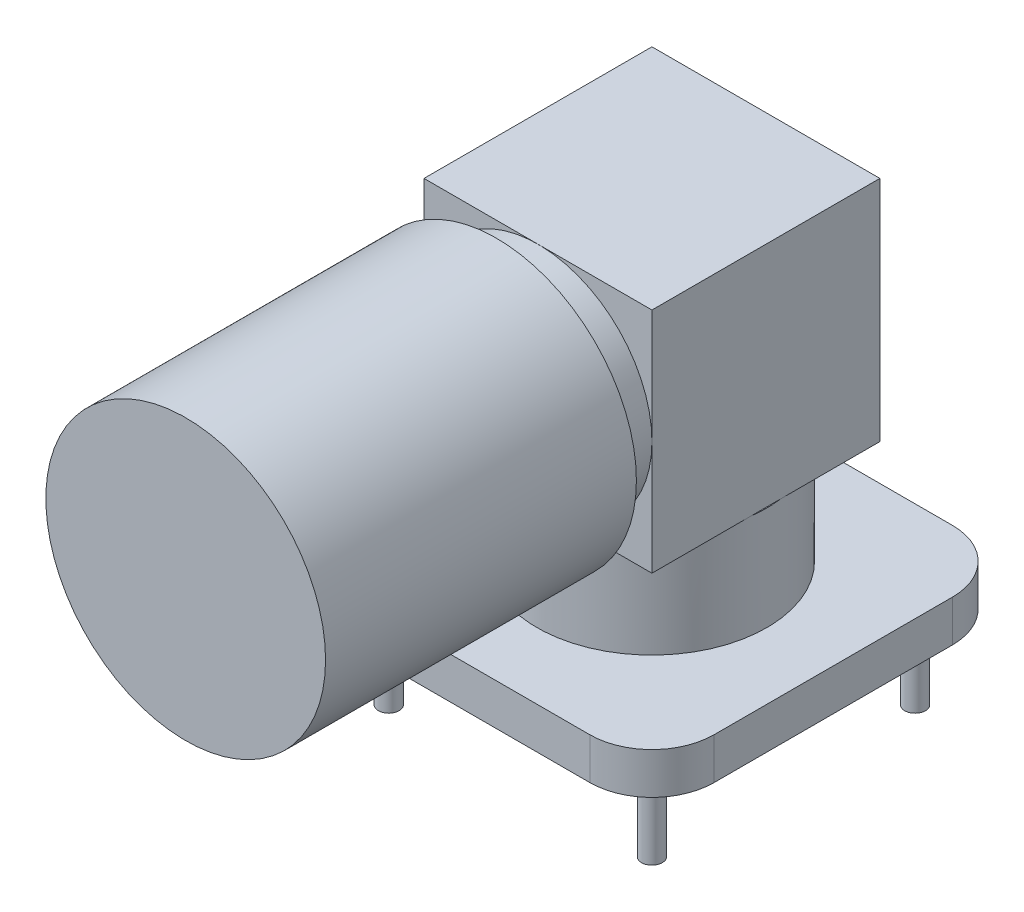
ISO-10303-21;
HEADER;
FILE_DESCRIPTION(('STEP AP214'),'2;1');
FILE_NAME('part.step','',(''),(''),'','','');
FILE_SCHEMA(('AUTOMOTIVE_DESIGN { 1 0 10303 214 1 1 1 1 }'));
ENDSEC;
DATA;
#1=APPLICATION_CONTEXT('core data for automotive mechanical design processes');
#2=APPLICATION_PROTOCOL_DEFINITION('international standard','automotive_design',2000,#1);
#3=PRODUCT_CONTEXT('',#1,'mechanical');
#4=PRODUCT('Part','Part','',(#3));
#5=PRODUCT_RELATED_PRODUCT_CATEGORY('part','',(#4));
#6=PRODUCT_DEFINITION_FORMATION('','',#4);
#7=PRODUCT_DEFINITION_CONTEXT('part definition',#1,'design');
#8=PRODUCT_DEFINITION('design','',#6,#7);
#9=PRODUCT_DEFINITION_SHAPE('','',#8);
#10=(LENGTH_UNIT() NAMED_UNIT(*) SI_UNIT(.MILLI.,.METRE.));
#11=(NAMED_UNIT(*) PLANE_ANGLE_UNIT() SI_UNIT($,.RADIAN.));
#12=(NAMED_UNIT(*) SI_UNIT($,.STERADIAN.) SOLID_ANGLE_UNIT());
#13=UNCERTAINTY_MEASURE_WITH_UNIT(LENGTH_MEASURE(1.E-05),#10,'distance_accuracy_value','');
#14=(GEOMETRIC_REPRESENTATION_CONTEXT(3) GLOBAL_UNCERTAINTY_ASSIGNED_CONTEXT((#13)) GLOBAL_UNIT_ASSIGNED_CONTEXT((#10,
#11,#12)) REPRESENTATION_CONTEXT('',''));
#15=CARTESIAN_POINT('',(0.,0.,0.));
#16=DIRECTION('',(0.,0.,1.));
#17=DIRECTION('',(1.,0.,0.));
#18=AXIS2_PLACEMENT_3D('',#15,#16,#17);
#19=CARTESIAN_POINT('',(0.,12.5,22.5));
#20=DIRECTION('',(0.,0.,-1.));
#21=DIRECTION('',(-1.,0.,0.));
#22=AXIS2_PLACEMENT_3D('',#19,#20,#21);
#23=CYLINDRICAL_SURFACE('',#22,6.75);
#24=CARTESIAN_POINT('',(0.,12.5,22.5));
#25=DIRECTION('',(0.,0.,1.));
#26=DIRECTION('',(1.,0.,0.));
#27=AXIS2_PLACEMENT_3D('',#24,#25,#26);
#28=CIRCLE('',#27,6.75);
#29=CARTESIAN_POINT('',(6.75,12.5,22.5));
#30=VERTEX_POINT('',#29);
#31=EDGE_CURVE('E11',#30,#30,#28,.T.);
#32=ORIENTED_EDGE('',*,*,#31,.F.);
#33=EDGE_LOOP('',(#32));
#34=FACE_BOUND('',#33,.T.);
#35=CARTESIAN_POINT('',(0.,12.5,7.5));
#36=DIRECTION('',(0.,0.,1.));
#37=DIRECTION('',(1.,0.,0.));
#38=AXIS2_PLACEMENT_3D('',#35,#36,#37);
#39=CIRCLE('',#38,6.75);
#40=CARTESIAN_POINT('',(6.75,12.5,7.5));
#41=VERTEX_POINT('',#40);
#42=EDGE_CURVE('E46',#41,#41,#39,.T.);
#43=ORIENTED_EDGE('',*,*,#42,.T.);
#44=EDGE_LOOP('',(#43));
#45=FACE_BOUND('',#44,.T.);
#46=ADVANCED_FACE('F43',(#34,#45),#23,.T.);
#47=CARTESIAN_POINT('',(0.,12.5,22.5));
#48=DIRECTION('',(0.,0.,1.));
#49=DIRECTION('',(1.,0.,0.));
#50=AXIS2_PLACEMENT_3D('',#47,#48,#49);
#51=PLANE('',#50);
#52=ORIENTED_EDGE('',*,*,#31,.T.);
#53=EDGE_LOOP('',(#52));
#54=FACE_BOUND('',#53,.T.);
#55=ADVANCED_FACE('F58',(#54),#51,.T.);
#56=CARTESIAN_POINT('',(0.,12.5,7.5));
#57=DIRECTION('',(0.,0.,1.));
#58=DIRECTION('',(1.,0.,0.));
#59=AXIS2_PLACEMENT_3D('',#56,#57,#58);
#60=PLANE('',#59);
#61=ORIENTED_EDGE('',*,*,#42,.F.);
#62=EDGE_LOOP('',(#61));
#63=FACE_BOUND('',#62,.T.);
#64=ADVANCED_FACE('F56',(#63),#60,.F.);
#65=CLOSED_SHELL('',(#46,#55,#64));
#66=MANIFOLD_SOLID_BREP('B2',#65);
#67=CARTESIAN_POINT('',(0.,12.5,15.5));
#68=DIRECTION('',(0.,0.,-1.));
#69=DIRECTION('',(-1.,0.,0.));
#70=AXIS2_PLACEMENT_3D('',#67,#68,#69);
#71=CYLINDRICAL_SURFACE('',#70,5.5);
#72=CARTESIAN_POINT('',(0.,12.5,15.5));
#73=DIRECTION('',(0.,0.,1.));
#74=DIRECTION('',(1.,0.,0.));
#75=AXIS2_PLACEMENT_3D('',#72,#73,#74);
#76=CIRCLE('',#75,5.5);
#77=CARTESIAN_POINT('',(5.5,12.5,15.5));
#78=VERTEX_POINT('',#77);
#79=EDGE_CURVE('E42',#78,#78,#76,.T.);
#80=ORIENTED_EDGE('',*,*,#79,.F.);
#81=EDGE_LOOP('',(#80));
#82=FACE_BOUND('',#81,.T.);
#83=CARTESIAN_POINT('',(0.,12.5,5.5));
#84=DIRECTION('',(0.,0.,1.));
#85=DIRECTION('',(1.,0.,0.));
#86=AXIS2_PLACEMENT_3D('',#83,#84,#85);
#87=CIRCLE('',#86,5.5);
#88=CARTESIAN_POINT('',(5.5,12.5,5.5));
#89=VERTEX_POINT('',#88);
#90=EDGE_CURVE('E95',#89,#89,#87,.T.);
#91=ORIENTED_EDGE('',*,*,#90,.T.);
#92=EDGE_LOOP('',(#91));
#93=FACE_BOUND('',#92,.T.);
#94=ADVANCED_FACE('F92',(#82,#93),#71,.T.);
#95=CARTESIAN_POINT('',(0.,12.5,15.5));
#96=DIRECTION('',(0.,0.,1.));
#97=DIRECTION('',(1.,0.,0.));
#98=AXIS2_PLACEMENT_3D('',#95,#96,#97);
#99=PLANE('',#98);
#100=ORIENTED_EDGE('',*,*,#79,.T.);
#101=EDGE_LOOP('',(#100));
#102=FACE_BOUND('',#101,.T.);
#103=ADVANCED_FACE('F107',(#102),#99,.T.);
#104=CARTESIAN_POINT('',(0.,12.5,5.5));
#105=DIRECTION('',(0.,0.,1.));
#106=DIRECTION('',(1.,0.,0.));
#107=AXIS2_PLACEMENT_3D('',#104,#105,#106);
#108=PLANE('',#107);
#109=ORIENTED_EDGE('',*,*,#90,.F.);
#110=EDGE_LOOP('',(#109));
#111=FACE_BOUND('',#110,.T.);
#112=ADVANCED_FACE('F105',(#111),#108,.F.);
#113=CLOSED_SHELL('',(#94,#103,#112));
#114=MANIFOLD_SOLID_BREP('B6',#113);
#115=CARTESIAN_POINT('',(0.,7.,0.));
#116=DIRECTION('',(0.,1.,0.));
#117=DIRECTION('',(0.,0.,1.));
#118=AXIS2_PLACEMENT_3D('',#115,#116,#117);
#119=PLANE('',#118);
#120=DIRECTION('',(0.,0.,-1.));
#121=VECTOR('',#120,1.);
#122=CARTESIAN_POINT('',(5.5,7.,-5.5));
#123=LINE('',#122,#121);
#124=CARTESIAN_POINT('',(5.5,7.,0.743303437365921));
#125=VERTEX_POINT('',#124);
#126=CARTESIAN_POINT('',(5.5,7.,-0.743303437365923));
#127=VERTEX_POINT('',#126);
#128=EDGE_CURVE('E90',#125,#127,#123,.T.);
#129=ORIENTED_EDGE('',*,*,#128,.F.);
#130=CARTESIAN_POINT('',(0.,7.,0.));
#131=DIRECTION('',(0.,1.,0.));
#132=DIRECTION('',(0.,0.,1.));
#133=AXIS2_PLACEMENT_3D('',#130,#131,#132);
#134=CIRCLE('',#133,5.55);
#135=EDGE_CURVE('E285',#125,#127,#134,.T.);
#136=ORIENTED_EDGE('',*,*,#135,.T.);
#137=EDGE_LOOP('',(#129,#136));
#138=FACE_BOUND('',#137,.T.);
#139=ADVANCED_FACE('F132',(#138),#119,.T.);
#140=DIRECTION('',(1.,0.,0.));
#141=VECTOR('',#140,1.);
#142=CARTESIAN_POINT('',(-5.5,7.,5.5));
#143=LINE('',#142,#141);
#144=CARTESIAN_POINT('',(-0.743303437365922,7.,5.5));
#145=VERTEX_POINT('',#144);
#146=CARTESIAN_POINT('',(0.743303437365922,7.,5.5));
#147=VERTEX_POINT('',#146);
#148=EDGE_CURVE('E141',#145,#147,#143,.T.);
#149=ORIENTED_EDGE('',*,*,#148,.F.);
#150=EDGE_CURVE('E275',#145,#147,#134,.T.);
#151=ORIENTED_EDGE('',*,*,#150,.T.);
#152=EDGE_LOOP('',(#149,#151));
#153=FACE_BOUND('',#152,.T.);
#154=ADVANCED_FACE('F438',(#153),#119,.T.);
#155=DIRECTION('',(0.,0.,1.));
#156=VECTOR('',#155,1.);
#157=CARTESIAN_POINT('',(-5.5,7.,-5.5));
#158=LINE('',#157,#156);
#159=CARTESIAN_POINT('',(-5.5,7.,-0.743303437365934));
#160=VERTEX_POINT('',#159);
#161=CARTESIAN_POINT('',(-5.5,7.,0.743303437365937));
#162=VERTEX_POINT('',#161);
#163=EDGE_CURVE('E378',#160,#162,#158,.T.);
#164=ORIENTED_EDGE('',*,*,#163,.F.);
#165=EDGE_CURVE('E408',#160,#162,#134,.T.);
#166=ORIENTED_EDGE('',*,*,#165,.T.);
#167=EDGE_LOOP('',(#164,#166));
#168=FACE_BOUND('',#167,.T.);
#169=ADVANCED_FACE('F443',(#168),#119,.T.);
#170=CARTESIAN_POINT('',(-5.75000000000001,2.,5.75));
#171=DIRECTION('',(0.,-1.,0.));
#172=DIRECTION('',(0.,0.,-1.));
#173=AXIS2_PLACEMENT_3D('',#170,#171,#172);
#174=PLANE('',#173);
#175=CARTESIAN_POINT('',(-5.75000000000001,2.,5.75));
#176=DIRECTION('',(0.,1.,0.));
#177=DIRECTION('',(0.,0.,-1.));
#178=AXIS2_PLACEMENT_3D('',#175,#176,#177);
#179=CIRCLE('',#178,3.);
#180=CARTESIAN_POINT('',(-8.75000000000001,2.,5.74999999999998));
#181=VERTEX_POINT('',#180);
#182=CARTESIAN_POINT('',(-5.74999999999999,2.,8.75));
#183=VERTEX_POINT('',#182);
#184=EDGE_CURVE('E316',#181,#183,#179,.T.);
#185=ORIENTED_EDGE('',*,*,#184,.T.);
#186=DIRECTION('',(1.,0.,0.));
#187=VECTOR('',#186,1.);
#188=CARTESIAN_POINT('',(-5.74999999999999,2.,8.75));
#189=LINE('',#188,#187);
#190=CARTESIAN_POINT('',(5.74999999999997,2.,8.75));
#191=VERTEX_POINT('',#190);
#192=EDGE_CURVE('E319',#183,#191,#189,.T.);
#193=ORIENTED_EDGE('',*,*,#192,.T.);
#194=CARTESIAN_POINT('',(5.74999999999999,2.,5.75));
#195=DIRECTION('',(0.,1.,0.));
#196=DIRECTION('',(0.,0.,1.));
#197=AXIS2_PLACEMENT_3D('',#194,#195,#196);
#198=CIRCLE('',#197,3.);
#199=CARTESIAN_POINT('',(8.74999999999999,2.,5.74999999999998));
#200=VERTEX_POINT('',#199);
#201=EDGE_CURVE('E322',#191,#200,#198,.T.);
#202=ORIENTED_EDGE('',*,*,#201,.T.);
#203=DIRECTION('',(0.,0.,-1.));
#204=VECTOR('',#203,1.);
#205=CARTESIAN_POINT('',(8.74999999999999,2.,5.74999999999998));
#206=LINE('',#205,#204);
#207=CARTESIAN_POINT('',(8.74999999999999,2.,-5.74999999999998));
#208=VERTEX_POINT('',#207);
#209=EDGE_CURVE('E324',#200,#208,#206,.T.);
#210=ORIENTED_EDGE('',*,*,#209,.T.);
#211=CARTESIAN_POINT('',(5.74999999999999,2.,-5.75));
#212=DIRECTION('',(0.,1.,0.));
#213=DIRECTION('',(0.,0.,-1.));
#214=AXIS2_PLACEMENT_3D('',#211,#212,#213);
#215=CIRCLE('',#214,3.);
#216=CARTESIAN_POINT('',(5.74999999999997,2.,-8.75));
#217=VERTEX_POINT('',#216);
#218=EDGE_CURVE('E326',#208,#217,#215,.T.);
#219=ORIENTED_EDGE('',*,*,#218,.T.);
#220=DIRECTION('',(-1.,0.,0.));
#221=VECTOR('',#220,1.);
#222=CARTESIAN_POINT('',(-5.74999999999999,2.,-8.75));
#223=LINE('',#222,#221);
#224=CARTESIAN_POINT('',(-5.74999999999999,2.,-8.75));
#225=VERTEX_POINT('',#224);
#226=EDGE_CURVE('E328',#217,#225,#223,.T.);
#227=ORIENTED_EDGE('',*,*,#226,.T.);
#228=CARTESIAN_POINT('',(-5.75000000000001,2.,-5.75));
#229=DIRECTION('',(0.,1.,0.));
#230=DIRECTION('',(0.,0.,-1.));
#231=AXIS2_PLACEMENT_3D('',#228,#229,#230);
#232=CIRCLE('',#231,3.);
#233=CARTESIAN_POINT('',(-8.75000000000001,2.,-5.74999999999998));
#234=VERTEX_POINT('',#233);
#235=EDGE_CURVE('E330',#225,#234,#232,.T.);
#236=ORIENTED_EDGE('',*,*,#235,.T.);
#237=DIRECTION('',(0.,0.,1.));
#238=VECTOR('',#237,1.);
#239=CARTESIAN_POINT('',(-8.75000000000001,2.,5.74999999999998));
#240=LINE('',#239,#238);
#241=EDGE_CURVE('E332',#234,#181,#240,.T.);
#242=ORIENTED_EDGE('',*,*,#241,.T.);
#243=EDGE_LOOP('',(#185,#193,#202,#210,#219,#227,#236,#242));
#244=FACE_BOUND('',#243,.T.);
#245=CARTESIAN_POINT('',(0.,2.,0.));
#246=DIRECTION('',(0.,-1.,0.));
#247=DIRECTION('',(0.,0.,-1.));
#248=AXIS2_PLACEMENT_3D('',#245,#246,#247);
#249=CIRCLE('',#248,5.55);
#250=CARTESIAN_POINT('',(0.,2.,-5.55));
#251=VERTEX_POINT('',#250);
#252=EDGE_CURVE('E136',#251,#251,#249,.F.);
#253=ORIENTED_EDGE('',*,*,#252,.F.);
#254=EDGE_LOOP('',(#253));
#255=FACE_BOUND('',#254,.T.);
#256=ADVANCED_FACE('F453',(#244,#255),#174,.F.);
#257=CARTESIAN_POINT('',(-5.75000000000001,0.,5.75));
#258=DIRECTION('',(0.,-1.,0.));
#259=DIRECTION('',(0.,0.,-1.));
#260=AXIS2_PLACEMENT_3D('',#257,#258,#259);
#261=PLANE('',#260);
#262=CARTESIAN_POINT('',(6.35,0.,6.35));
#263=DIRECTION('',(0.,-1.,0.));
#264=DIRECTION('',(0.,0.,-1.));
#265=AXIS2_PLACEMENT_3D('',#262,#263,#264);
#266=CIRCLE('',#265,0.5);
#267=CARTESIAN_POINT('',(6.35,0.,5.85));
#268=VERTEX_POINT('',#267);
#269=EDGE_CURVE('E289',#268,#268,#266,.T.);
#270=ORIENTED_EDGE('',*,*,#269,.F.);
#271=EDGE_LOOP('',(#270));
#272=FACE_BOUND('',#271,.T.);
#273=CARTESIAN_POINT('',(0.,0.,0.));
#274=DIRECTION('',(0.,-1.,0.));
#275=DIRECTION('',(0.,0.,-1.));
#276=AXIS2_PLACEMENT_3D('',#273,#274,#275);
#277=CIRCLE('',#276,0.5);
#278=CARTESIAN_POINT('',(0.,0.,-0.5));
#279=VERTEX_POINT('',#278);
#280=EDGE_CURVE('E301',#279,#279,#277,.T.);
#281=ORIENTED_EDGE('',*,*,#280,.F.);
#282=EDGE_LOOP('',(#281));
#283=FACE_BOUND('',#282,.T.);
#284=CARTESIAN_POINT('',(-5.75000000000001,0.,5.75));
#285=DIRECTION('',(0.,1.,0.));
#286=DIRECTION('',(0.,0.,-1.));
#287=AXIS2_PLACEMENT_3D('',#284,#285,#286);
#288=CIRCLE('',#287,3.);
#289=CARTESIAN_POINT('',(-8.75000000000001,0.,5.74999999999998));
#290=VERTEX_POINT('',#289);
#291=CARTESIAN_POINT('',(-5.74999999999999,0.,8.75));
#292=VERTEX_POINT('',#291);
#293=EDGE_CURVE('E313',#290,#292,#288,.T.);
#294=ORIENTED_EDGE('',*,*,#293,.F.);
#295=DIRECTION('',(0.,0.,1.));
#296=VECTOR('',#295,1.);
#297=CARTESIAN_POINT('',(-8.75000000000001,0.,5.74999999999998));
#298=LINE('',#297,#296);
#299=CARTESIAN_POINT('',(-8.75000000000001,0.,-5.74999999999998));
#300=VERTEX_POINT('',#299);
#301=EDGE_CURVE('E320',#300,#290,#298,.T.);
#302=ORIENTED_EDGE('',*,*,#301,.F.);
#303=CARTESIAN_POINT('',(-5.75000000000001,0.,-5.75));
#304=DIRECTION('',(0.,1.,0.));
#305=DIRECTION('',(0.,0.,-1.));
#306=AXIS2_PLACEMENT_3D('',#303,#304,#305);
#307=CIRCLE('',#306,3.);
#308=CARTESIAN_POINT('',(-5.74999999999999,0.,-8.75));
#309=VERTEX_POINT('',#308);
#310=EDGE_CURVE('E347',#309,#300,#307,.T.);
#311=ORIENTED_EDGE('',*,*,#310,.F.);
#312=DIRECTION('',(-1.,0.,0.));
#313=VECTOR('',#312,1.);
#314=CARTESIAN_POINT('',(-5.74999999999999,0.,-8.75));
#315=LINE('',#314,#313);
#316=CARTESIAN_POINT('',(5.74999999999997,0.,-8.75));
#317=VERTEX_POINT('',#316);
#318=EDGE_CURVE('E345',#317,#309,#315,.T.);
#319=ORIENTED_EDGE('',*,*,#318,.F.);
#320=CARTESIAN_POINT('',(5.74999999999999,0.,-5.75));
#321=DIRECTION('',(0.,1.,0.));
#322=DIRECTION('',(0.,0.,-1.));
#323=AXIS2_PLACEMENT_3D('',#320,#321,#322);
#324=CIRCLE('',#323,3.);
#325=CARTESIAN_POINT('',(8.74999999999999,0.,-5.74999999999998));
#326=VERTEX_POINT('',#325);
#327=EDGE_CURVE('E343',#326,#317,#324,.T.);
#328=ORIENTED_EDGE('',*,*,#327,.F.);
#329=DIRECTION('',(0.,0.,-1.));
#330=VECTOR('',#329,1.);
#331=CARTESIAN_POINT('',(8.74999999999999,0.,5.74999999999998));
#332=LINE('',#331,#330);
#333=CARTESIAN_POINT('',(8.74999999999999,0.,5.74999999999998));
#334=VERTEX_POINT('',#333);
#335=EDGE_CURVE('E341',#334,#326,#332,.T.);
#336=ORIENTED_EDGE('',*,*,#335,.F.);
#337=CARTESIAN_POINT('',(5.74999999999999,0.,5.75));
#338=DIRECTION('',(0.,1.,0.));
#339=DIRECTION('',(0.,0.,1.));
#340=AXIS2_PLACEMENT_3D('',#337,#338,#339);
#341=CIRCLE('',#340,3.);
#342=CARTESIAN_POINT('',(5.74999999999997,0.,8.75));
#343=VERTEX_POINT('',#342);
#344=EDGE_CURVE('E339',#343,#334,#341,.T.);
#345=ORIENTED_EDGE('',*,*,#344,.F.);
#346=DIRECTION('',(1.,0.,0.));
#347=VECTOR('',#346,1.);
#348=CARTESIAN_POINT('',(-5.74999999999999,0.,8.75));
#349=LINE('',#348,#347);
#350=EDGE_CURVE('E337',#292,#343,#349,.T.);
#351=ORIENTED_EDGE('',*,*,#350,.F.);
#352=EDGE_LOOP('',(#294,#302,#311,#319,#328,#336,#345,#351));
#353=FACE_BOUND('',#352,.T.);
#354=CARTESIAN_POINT('',(6.35,0.,-6.35));
#355=DIRECTION('',(0.,-1.,0.));
#356=DIRECTION('',(0.,0.,-1.));
#357=AXIS2_PLACEMENT_3D('',#354,#355,#356);
#358=CIRCLE('',#357,0.500000000000001);
#359=CARTESIAN_POINT('',(6.35,0.,-6.85));
#360=VERTEX_POINT('',#359);
#361=EDGE_CURVE('E307',#360,#360,#358,.T.);
#362=ORIENTED_EDGE('',*,*,#361,.F.);
#363=EDGE_LOOP('',(#362));
#364=FACE_BOUND('',#363,.T.);
#365=CARTESIAN_POINT('',(-6.35,0.,6.35));
#366=DIRECTION('',(0.,-1.,0.));
#367=DIRECTION('',(0.,0.,-1.));
#368=AXIS2_PLACEMENT_3D('',#365,#366,#367);
#369=CIRCLE('',#368,0.5);
#370=CARTESIAN_POINT('',(-6.35,0.,5.85));
#371=VERTEX_POINT('',#370);
#372=EDGE_CURVE('E295',#371,#371,#369,.T.);
#373=ORIENTED_EDGE('',*,*,#372,.F.);
#374=EDGE_LOOP('',(#373));
#375=FACE_BOUND('',#374,.T.);
#376=CARTESIAN_POINT('',(-6.35,0.,-6.35));
#377=DIRECTION('',(0.,-1.,0.));
#378=DIRECTION('',(0.,0.,-1.));
#379=AXIS2_PLACEMENT_3D('',#376,#377,#378);
#380=CIRCLE('',#379,0.5);
#381=CARTESIAN_POINT('',(-6.35,0.,-6.85));
#382=VERTEX_POINT('',#381);
#383=EDGE_CURVE('E284',#382,#382,#380,.T.);
#384=ORIENTED_EDGE('',*,*,#383,.F.);
#385=EDGE_LOOP('',(#384));
#386=FACE_BOUND('',#385,.T.);
#387=ADVANCED_FACE('F457',(#272,#283,#353,#364,#375,#386),#261,.T.);
#388=CARTESIAN_POINT('',(-5.75000000000001,2.,5.75));
#389=DIRECTION('',(0.,-1.,0.));
#390=DIRECTION('',(0.,0.,-1.));
#391=AXIS2_PLACEMENT_3D('',#388,#389,#390);
#392=CYLINDRICAL_SURFACE('',#391,3.);
#393=ORIENTED_EDGE('',*,*,#293,.T.);
#394=DIRECTION('',(0.,-1.,0.));
#395=VECTOR('',#394,1.);
#396=CARTESIAN_POINT('',(-5.74999999999999,2.,8.75));
#397=LINE('',#396,#395);
#398=EDGE_CURVE('E369',#183,#292,#397,.T.);
#399=ORIENTED_EDGE('',*,*,#398,.F.);
#400=ORIENTED_EDGE('',*,*,#184,.F.);
#401=DIRECTION('',(0.,-1.,0.));
#402=VECTOR('',#401,1.);
#403=CARTESIAN_POINT('',(-8.75000000000001,2.,5.74999999999998));
#404=LINE('',#403,#402);
#405=EDGE_CURVE('E334',#181,#290,#404,.T.);
#406=ORIENTED_EDGE('',*,*,#405,.T.);
#407=EDGE_LOOP('',(#393,#399,#400,#406));
#408=FACE_BOUND('',#407,.T.);
#409=ADVANCED_FACE('F134',(#408),#392,.T.);
#410=CARTESIAN_POINT('',(-5.74999999999999,2.,8.75));
#411=DIRECTION('',(0.,0.,-1.));
#412=DIRECTION('',(-1.,0.,0.));
#413=AXIS2_PLACEMENT_3D('',#410,#411,#412);
#414=PLANE('',#413);
#415=ORIENTED_EDGE('',*,*,#350,.T.);
#416=DIRECTION('',(0.,-1.,0.));
#417=VECTOR('',#416,1.);
#418=CARTESIAN_POINT('',(5.74999999999997,2.,8.75));
#419=LINE('',#418,#417);
#420=EDGE_CURVE('E367',#191,#343,#419,.T.);
#421=ORIENTED_EDGE('',*,*,#420,.F.);
#422=ORIENTED_EDGE('',*,*,#192,.F.);
#423=ORIENTED_EDGE('',*,*,#398,.T.);
#424=EDGE_LOOP('',(#415,#421,#422,#423));
#425=FACE_BOUND('',#424,.T.);
#426=ADVANCED_FACE('F492',(#425),#414,.F.);
#427=CARTESIAN_POINT('',(5.74999999999999,2.,5.75));
#428=DIRECTION('',(0.,-1.,0.));
#429=DIRECTION('',(0.,0.,-1.));
#430=AXIS2_PLACEMENT_3D('',#427,#428,#429);
#431=CYLINDRICAL_SURFACE('',#430,3.);
#432=ORIENTED_EDGE('',*,*,#344,.T.);
#433=DIRECTION('',(0.,-1.,0.));
#434=VECTOR('',#433,1.);
#435=CARTESIAN_POINT('',(8.74999999999999,2.,5.74999999999998));
#436=LINE('',#435,#434);
#437=EDGE_CURVE('E364',#200,#334,#436,.T.);
#438=ORIENTED_EDGE('',*,*,#437,.F.);
#439=ORIENTED_EDGE('',*,*,#201,.F.);
#440=ORIENTED_EDGE('',*,*,#420,.T.);
#441=EDGE_LOOP('',(#432,#438,#439,#440));
#442=FACE_BOUND('',#441,.T.);
#443=ADVANCED_FACE('F489',(#442),#431,.T.);
#444=CARTESIAN_POINT('',(8.74999999999999,2.,5.74999999999998));
#445=DIRECTION('',(-1.,0.,0.));
#446=DIRECTION('',(0.,0.,1.));
#447=AXIS2_PLACEMENT_3D('',#444,#445,#446);
#448=PLANE('',#447);
#449=ORIENTED_EDGE('',*,*,#335,.T.);
#450=DIRECTION('',(0.,-1.,0.));
#451=VECTOR('',#450,1.);
#452=CARTESIAN_POINT('',(8.74999999999999,2.,-5.74999999999998));
#453=LINE('',#452,#451);
#454=EDGE_CURVE('E361',#208,#326,#453,.T.);
#455=ORIENTED_EDGE('',*,*,#454,.F.);
#456=ORIENTED_EDGE('',*,*,#209,.F.);
#457=ORIENTED_EDGE('',*,*,#437,.T.);
#458=EDGE_LOOP('',(#449,#455,#456,#457));
#459=FACE_BOUND('',#458,.T.);
#460=ADVANCED_FACE('F485',(#459),#448,.F.);
#461=CARTESIAN_POINT('',(5.74999999999999,2.,-5.75));
#462=DIRECTION('',(0.,-1.,0.));
#463=DIRECTION('',(0.,0.,-1.));
#464=AXIS2_PLACEMENT_3D('',#461,#462,#463);
#465=CYLINDRICAL_SURFACE('',#464,3.);
#466=ORIENTED_EDGE('',*,*,#327,.T.);
#467=DIRECTION('',(0.,-1.,0.));
#468=VECTOR('',#467,1.);
#469=CARTESIAN_POINT('',(5.74999999999997,2.,-8.75));
#470=LINE('',#469,#468);
#471=EDGE_CURVE('E358',#217,#317,#470,.T.);
#472=ORIENTED_EDGE('',*,*,#471,.F.);
#473=ORIENTED_EDGE('',*,*,#218,.F.);
#474=ORIENTED_EDGE('',*,*,#454,.T.);
#475=EDGE_LOOP('',(#466,#472,#473,#474));
#476=FACE_BOUND('',#475,.T.);
#477=ADVANCED_FACE('F481',(#476),#465,.T.);
#478=CARTESIAN_POINT('',(-5.74999999999999,2.,-8.75));
#479=DIRECTION('',(0.,0.,1.));
#480=DIRECTION('',(1.,0.,0.));
#481=AXIS2_PLACEMENT_3D('',#478,#479,#480);
#482=PLANE('',#481);
#483=ORIENTED_EDGE('',*,*,#318,.T.);
#484=DIRECTION('',(0.,-1.,0.));
#485=VECTOR('',#484,1.);
#486=CARTESIAN_POINT('',(-5.74999999999999,2.,-8.75));
#487=LINE('',#486,#485);
#488=EDGE_CURVE('E355',#225,#309,#487,.T.);
#489=ORIENTED_EDGE('',*,*,#488,.F.);
#490=ORIENTED_EDGE('',*,*,#226,.F.);
#491=ORIENTED_EDGE('',*,*,#471,.T.);
#492=EDGE_LOOP('',(#483,#489,#490,#491));
#493=FACE_BOUND('',#492,.T.);
#494=ADVANCED_FACE('F477',(#493),#482,.F.);
#495=CARTESIAN_POINT('',(-5.75000000000001,2.,-5.75));
#496=DIRECTION('',(0.,-1.,0.));
#497=DIRECTION('',(0.,0.,-1.));
#498=AXIS2_PLACEMENT_3D('',#495,#496,#497);
#499=CYLINDRICAL_SURFACE('',#498,3.);
#500=ORIENTED_EDGE('',*,*,#310,.T.);
#501=DIRECTION('',(0.,-1.,0.));
#502=VECTOR('',#501,1.);
#503=CARTESIAN_POINT('',(-8.75000000000001,2.,-5.74999999999998));
#504=LINE('',#503,#502);
#505=EDGE_CURVE('E352',#234,#300,#504,.T.);
#506=ORIENTED_EDGE('',*,*,#505,.F.);
#507=ORIENTED_EDGE('',*,*,#235,.F.);
#508=ORIENTED_EDGE('',*,*,#488,.T.);
#509=EDGE_LOOP('',(#500,#506,#507,#508));
#510=FACE_BOUND('',#509,.T.);
#511=ADVANCED_FACE('F473',(#510),#499,.T.);
#512=CARTESIAN_POINT('',(-8.75000000000001,2.,5.74999999999998));
#513=DIRECTION('',(1.,0.,0.));
#514=DIRECTION('',(0.,0.,-1.));
#515=AXIS2_PLACEMENT_3D('',#512,#513,#514);
#516=PLANE('',#515);
#517=ORIENTED_EDGE('',*,*,#301,.T.);
#518=ORIENTED_EDGE('',*,*,#405,.F.);
#519=ORIENTED_EDGE('',*,*,#241,.F.);
#520=ORIENTED_EDGE('',*,*,#505,.T.);
#521=EDGE_LOOP('',(#517,#518,#519,#520));
#522=FACE_BOUND('',#521,.T.);
#523=ADVANCED_FACE('F470',(#522),#516,.F.);
#524=CARTESIAN_POINT('',(6.35,-4.,-6.35));
#525=DIRECTION('',(0.,1.,0.));
#526=DIRECTION('',(0.,0.,1.));
#527=AXIS2_PLACEMENT_3D('',#524,#525,#526);
#528=CYLINDRICAL_SURFACE('',#527,0.500000000000001);
#529=CARTESIAN_POINT('',(6.35,-4.,-6.35));
#530=DIRECTION('',(0.,-1.,0.));
#531=DIRECTION('',(0.,0.,-1.));
#532=AXIS2_PLACEMENT_3D('',#529,#530,#531);
#533=CIRCLE('',#532,0.500000000000001);
#534=CARTESIAN_POINT('',(6.35,-4.,-6.85));
#535=VERTEX_POINT('',#534);
#536=EDGE_CURVE('E310',#535,#535,#533,.T.);
#537=ORIENTED_EDGE('',*,*,#536,.F.);
#538=EDGE_LOOP('',(#537));
#539=FACE_BOUND('',#538,.T.);
#540=ORIENTED_EDGE('',*,*,#361,.T.);
#541=EDGE_LOOP('',(#540));
#542=FACE_BOUND('',#541,.T.);
#543=ADVANCED_FACE('F467',(#539,#542),#528,.T.);
#544=CARTESIAN_POINT('',(6.35,-4.,-6.35));
#545=DIRECTION('',(0.,-1.,0.));
#546=DIRECTION('',(0.,0.,-1.));
#547=AXIS2_PLACEMENT_3D('',#544,#545,#546);
#548=PLANE('',#547);
#549=ORIENTED_EDGE('',*,*,#536,.T.);
#550=EDGE_LOOP('',(#549));
#551=FACE_BOUND('',#550,.T.);
#552=ADVANCED_FACE('F561',(#551),#548,.T.);
#553=CARTESIAN_POINT('',(0.,-4.,0.));
#554=DIRECTION('',(0.,1.,0.));
#555=DIRECTION('',(0.,0.,1.));
#556=AXIS2_PLACEMENT_3D('',#553,#554,#555);
#557=CYLINDRICAL_SURFACE('',#556,0.5);
#558=CARTESIAN_POINT('',(0.,-4.,0.));
#559=DIRECTION('',(0.,-1.,0.));
#560=DIRECTION('',(0.,0.,-1.));
#561=AXIS2_PLACEMENT_3D('',#558,#559,#560);
#562=CIRCLE('',#561,0.5);
#563=CARTESIAN_POINT('',(0.,-4.,-0.5));
#564=VERTEX_POINT('',#563);
#565=EDGE_CURVE('E304',#564,#564,#562,.T.);
#566=ORIENTED_EDGE('',*,*,#565,.F.);
#567=EDGE_LOOP('',(#566));
#568=FACE_BOUND('',#567,.T.);
#569=ORIENTED_EDGE('',*,*,#280,.T.);
#570=EDGE_LOOP('',(#569));
#571=FACE_BOUND('',#570,.T.);
#572=ADVANCED_FACE('F558',(#568,#571),#557,.T.);
#573=CARTESIAN_POINT('',(0.,-4.,0.));
#574=DIRECTION('',(0.,-1.,0.));
#575=DIRECTION('',(0.,0.,-1.));
#576=AXIS2_PLACEMENT_3D('',#573,#574,#575);
#577=PLANE('',#576);
#578=ORIENTED_EDGE('',*,*,#565,.T.);
#579=EDGE_LOOP('',(#578));
#580=FACE_BOUND('',#579,.T.);
#581=ADVANCED_FACE('F554',(#580),#577,.T.);
#582=CARTESIAN_POINT('',(-6.35,-4.,6.35));
#583=DIRECTION('',(0.,1.,0.));
#584=DIRECTION('',(0.,0.,1.));
#585=AXIS2_PLACEMENT_3D('',#582,#583,#584);
#586=CYLINDRICAL_SURFACE('',#585,0.5);
#587=CARTESIAN_POINT('',(-6.35,-4.,6.35));
#588=DIRECTION('',(0.,-1.,0.));
#589=DIRECTION('',(0.,0.,-1.));
#590=AXIS2_PLACEMENT_3D('',#587,#588,#589);
#591=CIRCLE('',#590,0.5);
#592=CARTESIAN_POINT('',(-6.35,-4.,5.85));
#593=VERTEX_POINT('',#592);
#594=EDGE_CURVE('E298',#593,#593,#591,.T.);
#595=ORIENTED_EDGE('',*,*,#594,.F.);
#596=EDGE_LOOP('',(#595));
#597=FACE_BOUND('',#596,.T.);
#598=ORIENTED_EDGE('',*,*,#372,.T.);
#599=EDGE_LOOP('',(#598));
#600=FACE_BOUND('',#599,.T.);
#601=ADVANCED_FACE('F550',(#597,#600),#586,.T.);
#602=CARTESIAN_POINT('',(-6.35,-4.,6.35));
#603=DIRECTION('',(0.,-1.,0.));
#604=DIRECTION('',(0.,0.,-1.));
#605=AXIS2_PLACEMENT_3D('',#602,#603,#604);
#606=PLANE('',#605);
#607=ORIENTED_EDGE('',*,*,#594,.T.);
#608=EDGE_LOOP('',(#607));
#609=FACE_BOUND('',#608,.T.);
#610=ADVANCED_FACE('F546',(#609),#606,.T.);
#611=CARTESIAN_POINT('',(6.35,-4.,6.35));
#612=DIRECTION('',(0.,1.,0.));
#613=DIRECTION('',(0.,0.,1.));
#614=AXIS2_PLACEMENT_3D('',#611,#612,#613);
#615=CYLINDRICAL_SURFACE('',#614,0.5);
#616=CARTESIAN_POINT('',(6.35,-4.,6.35));
#617=DIRECTION('',(0.,-1.,0.));
#618=DIRECTION('',(0.,0.,-1.));
#619=AXIS2_PLACEMENT_3D('',#616,#617,#618);
#620=CIRCLE('',#619,0.5);
#621=CARTESIAN_POINT('',(6.35,-4.,5.85));
#622=VERTEX_POINT('',#621);
#623=EDGE_CURVE('E292',#622,#622,#620,.T.);
#624=ORIENTED_EDGE('',*,*,#623,.F.);
#625=EDGE_LOOP('',(#624));
#626=FACE_BOUND('',#625,.T.);
#627=ORIENTED_EDGE('',*,*,#269,.T.);
#628=EDGE_LOOP('',(#627));
#629=FACE_BOUND('',#628,.T.);
#630=ADVANCED_FACE('F539',(#626,#629),#615,.T.);
#631=CARTESIAN_POINT('',(6.35,-4.,6.35));
#632=DIRECTION('',(0.,-1.,0.));
#633=DIRECTION('',(0.,0.,-1.));
#634=AXIS2_PLACEMENT_3D('',#631,#632,#633);
#635=PLANE('',#634);
#636=ORIENTED_EDGE('',*,*,#623,.T.);
#637=EDGE_LOOP('',(#636));
#638=FACE_BOUND('',#637,.T.);
#639=ADVANCED_FACE('F530',(#638),#635,.T.);
#640=CARTESIAN_POINT('',(-6.35,-4.,-6.35));
#641=DIRECTION('',(0.,1.,0.));
#642=DIRECTION('',(0.,0.,1.));
#643=AXIS2_PLACEMENT_3D('',#640,#641,#642);
#644=CYLINDRICAL_SURFACE('',#643,0.5);
#645=CARTESIAN_POINT('',(-6.35,-4.,-6.35));
#646=DIRECTION('',(0.,-1.,0.));
#647=DIRECTION('',(0.,0.,-1.));
#648=AXIS2_PLACEMENT_3D('',#645,#646,#647);
#649=CIRCLE('',#648,0.5);
#650=CARTESIAN_POINT('',(-6.35,-4.,-6.85));
#651=VERTEX_POINT('',#650);
#652=EDGE_CURVE('E286',#651,#651,#649,.T.);
#653=ORIENTED_EDGE('',*,*,#652,.F.);
#654=EDGE_LOOP('',(#653));
#655=FACE_BOUND('',#654,.T.);
#656=ORIENTED_EDGE('',*,*,#383,.T.);
#657=EDGE_LOOP('',(#656));
#658=FACE_BOUND('',#657,.T.);
#659=ADVANCED_FACE('F528',(#655,#658),#644,.T.);
#660=CARTESIAN_POINT('',(-6.35,-4.,-6.35));
#661=DIRECTION('',(0.,-1.,0.));
#662=DIRECTION('',(0.,0.,-1.));
#663=AXIS2_PLACEMENT_3D('',#660,#661,#662);
#664=PLANE('',#663);
#665=ORIENTED_EDGE('',*,*,#652,.T.);
#666=EDGE_LOOP('',(#665));
#667=FACE_BOUND('',#666,.T.);
#668=ADVANCED_FACE('F451',(#667),#664,.T.);
#669=CARTESIAN_POINT('',(0.,7.,0.));
#670=DIRECTION('',(0.,-1.,0.));
#671=DIRECTION('',(0.,0.,-1.));
#672=AXIS2_PLACEMENT_3D('',#669,#670,#671);
#673=CYLINDRICAL_SURFACE('',#672,5.55);
#674=EDGE_CURVE('E278',#147,#125,#134,.T.);
#675=ORIENTED_EDGE('',*,*,#674,.F.);
#676=ORIENTED_EDGE('',*,*,#150,.F.);
#677=EDGE_CURVE('E156',#162,#145,#134,.T.);
#678=ORIENTED_EDGE('',*,*,#677,.F.);
#679=ORIENTED_EDGE('',*,*,#165,.F.);
#680=CARTESIAN_POINT('',(-0.743303437365936,7.,-5.5));
#681=VERTEX_POINT('',#680);
#682=EDGE_CURVE('E409',#681,#160,#134,.T.);
#683=ORIENTED_EDGE('',*,*,#682,.F.);
#684=CARTESIAN_POINT('',(0.743303437365936,7.,-5.5));
#685=VERTEX_POINT('',#684);
#686=EDGE_CURVE('E412',#685,#681,#134,.T.);
#687=ORIENTED_EDGE('',*,*,#686,.F.);
#688=EDGE_CURVE('E415',#127,#685,#134,.T.);
#689=ORIENTED_EDGE('',*,*,#688,.F.);
#690=ORIENTED_EDGE('',*,*,#135,.F.);
#691=EDGE_LOOP('',(#675,#676,#678,#679,#683,#687,#689,#690));
#692=FACE_BOUND('',#691,.T.);
#693=ORIENTED_EDGE('',*,*,#252,.T.);
#694=EDGE_LOOP('',(#693));
#695=FACE_BOUND('',#694,.T.);
#696=ADVANCED_FACE('F447',(#692,#695),#673,.T.);
#697=DIRECTION('',(-1.,0.,0.));
#698=VECTOR('',#697,1.);
#699=CARTESIAN_POINT('',(-5.5,7.,-5.5));
#700=LINE('',#699,#698);
#701=EDGE_CURVE('E374',#685,#681,#700,.T.);
#702=ORIENTED_EDGE('',*,*,#701,.F.);
#703=ORIENTED_EDGE('',*,*,#686,.T.);
#704=EDGE_LOOP('',(#702,#703));
#705=FACE_BOUND('',#704,.T.);
#706=ADVANCED_FACE('F433',(#705),#119,.T.);
#707=CARTESIAN_POINT('',(0.,7.,0.));
#708=DIRECTION('',(0.,1.,0.));
#709=DIRECTION('',(0.,0.,1.));
#710=AXIS2_PLACEMENT_3D('',#707,#708,#709);
#711=PLANE('',#710);
#712=CARTESIAN_POINT('',(5.5,7.,5.5));
#713=VERTEX_POINT('',#712);
#714=EDGE_CURVE('E402',#147,#713,#143,.T.);
#715=ORIENTED_EDGE('',*,*,#714,.F.);
#716=ORIENTED_EDGE('',*,*,#674,.T.);
#717=EDGE_CURVE('E143',#713,#125,#123,.T.);
#718=ORIENTED_EDGE('',*,*,#717,.F.);
#719=EDGE_LOOP('',(#715,#716,#718));
#720=FACE_BOUND('',#719,.T.);
#721=ADVANCED_FACE('F427',(#720),#711,.F.);
#722=CARTESIAN_POINT('',(5.5,7.,-5.5));
#723=VERTEX_POINT('',#722);
#724=EDGE_CURVE('E144',#127,#723,#123,.T.);
#725=ORIENTED_EDGE('',*,*,#724,.F.);
#726=ORIENTED_EDGE('',*,*,#688,.T.);
#727=EDGE_CURVE('E380',#723,#685,#700,.T.);
#728=ORIENTED_EDGE('',*,*,#727,.F.);
#729=EDGE_LOOP('',(#725,#726,#728));
#730=FACE_BOUND('',#729,.T.);
#731=ADVANCED_FACE('F424',(#730),#711,.F.);
#732=CARTESIAN_POINT('',(-5.5,7.,-5.5));
#733=VERTEX_POINT('',#732);
#734=EDGE_CURVE('E381',#681,#733,#700,.T.);
#735=ORIENTED_EDGE('',*,*,#734,.F.);
#736=ORIENTED_EDGE('',*,*,#682,.T.);
#737=EDGE_CURVE('E384',#733,#160,#158,.T.);
#738=ORIENTED_EDGE('',*,*,#737,.F.);
#739=EDGE_LOOP('',(#735,#736,#738));
#740=FACE_BOUND('',#739,.T.);
#741=ADVANCED_FACE('F426',(#740),#711,.F.);
#742=CARTESIAN_POINT('',(-5.5,7.,5.5));
#743=VERTEX_POINT('',#742);
#744=EDGE_CURVE('E385',#162,#743,#158,.T.);
#745=ORIENTED_EDGE('',*,*,#744,.F.);
#746=ORIENTED_EDGE('',*,*,#677,.T.);
#747=EDGE_CURVE('E269',#743,#145,#143,.T.);
#748=ORIENTED_EDGE('',*,*,#747,.F.);
#749=EDGE_LOOP('',(#745,#746,#748));
#750=FACE_BOUND('',#749,.T.);
#751=ADVANCED_FACE('F407',(#750),#711,.F.);
#752=CARTESIAN_POINT('',(5.5,18.,-5.5));
#753=DIRECTION('',(-1.,0.,0.));
#754=DIRECTION('',(0.,0.,1.));
#755=AXIS2_PLACEMENT_3D('',#752,#753,#754);
#756=PLANE('',#755);
#757=ORIENTED_EDGE('',*,*,#717,.T.);
#758=ORIENTED_EDGE('',*,*,#128,.T.);
#759=ORIENTED_EDGE('',*,*,#724,.T.);
#760=DIRECTION('',(0.,-1.,0.));
#761=VECTOR('',#760,1.);
#762=CARTESIAN_POINT('',(5.5,18.,-5.5));
#763=LINE('',#762,#761);
#764=CARTESIAN_POINT('',(5.5,18.,-5.5));
#765=VERTEX_POINT('',#764);
#766=EDGE_CURVE('E254',#765,#723,#763,.T.);
#767=ORIENTED_EDGE('',*,*,#766,.F.);
#768=DIRECTION('',(0.,0.,-1.));
#769=VECTOR('',#768,1.);
#770=CARTESIAN_POINT('',(5.5,18.,-5.5));
#771=LINE('',#770,#769);
#772=CARTESIAN_POINT('',(5.5,18.,5.5));
#773=VERTEX_POINT('',#772);
#774=EDGE_CURVE('E260',#773,#765,#771,.T.);
#775=ORIENTED_EDGE('',*,*,#774,.F.);
#776=DIRECTION('',(0.,-1.,0.));
#777=VECTOR('',#776,1.);
#778=CARTESIAN_POINT('',(5.5,18.,5.5));
#779=LINE('',#778,#777);
#780=EDGE_CURVE('E390',#773,#713,#779,.T.);
#781=ORIENTED_EDGE('',*,*,#780,.T.);
#782=EDGE_LOOP('',(#757,#758,#759,#767,#775,#781));
#783=FACE_BOUND('',#782,.T.);
#784=ADVANCED_FACE('F272',(#783),#756,.F.);
#785=CARTESIAN_POINT('',(-5.5,18.,-5.5));
#786=DIRECTION('',(0.,0.,1.));
#787=DIRECTION('',(1.,0.,0.));
#788=AXIS2_PLACEMENT_3D('',#785,#786,#787);
#789=PLANE('',#788);
#790=ORIENTED_EDGE('',*,*,#727,.T.);
#791=ORIENTED_EDGE('',*,*,#701,.T.);
#792=ORIENTED_EDGE('',*,*,#734,.T.);
#793=DIRECTION('',(0.,-1.,0.));
#794=VECTOR('',#793,1.);
#795=CARTESIAN_POINT('',(-5.5,18.,-5.5));
#796=LINE('',#795,#794);
#797=CARTESIAN_POINT('',(-5.5,18.,-5.5));
#798=VERTEX_POINT('',#797);
#799=EDGE_CURVE('E256',#798,#733,#796,.T.);
#800=ORIENTED_EDGE('',*,*,#799,.F.);
#801=DIRECTION('',(-1.,0.,0.));
#802=VECTOR('',#801,1.);
#803=CARTESIAN_POINT('',(-5.5,18.,-5.5));
#804=LINE('',#803,#802);
#805=EDGE_CURVE('E249',#765,#798,#804,.T.);
#806=ORIENTED_EDGE('',*,*,#805,.F.);
#807=ORIENTED_EDGE('',*,*,#766,.T.);
#808=EDGE_LOOP('',(#790,#791,#792,#800,#806,#807));
#809=FACE_BOUND('',#808,.T.);
#810=ADVANCED_FACE('F252',(#809),#789,.F.);
#811=CARTESIAN_POINT('',(-5.5,18.,-5.5));
#812=DIRECTION('',(1.,0.,0.));
#813=DIRECTION('',(0.,0.,-1.));
#814=AXIS2_PLACEMENT_3D('',#811,#812,#813);
#815=PLANE('',#814);
#816=ORIENTED_EDGE('',*,*,#737,.T.);
#817=ORIENTED_EDGE('',*,*,#163,.T.);
#818=ORIENTED_EDGE('',*,*,#744,.T.);
#819=DIRECTION('',(0.,-1.,0.));
#820=VECTOR('',#819,1.);
#821=CARTESIAN_POINT('',(-5.5,18.,5.5));
#822=LINE('',#821,#820);
#823=CARTESIAN_POINT('',(-5.5,18.,5.5));
#824=VERTEX_POINT('',#823);
#825=EDGE_CURVE('E279',#824,#743,#822,.T.);
#826=ORIENTED_EDGE('',*,*,#825,.F.);
#827=DIRECTION('',(0.,0.,1.));
#828=VECTOR('',#827,1.);
#829=CARTESIAN_POINT('',(-5.5,18.,-5.5));
#830=LINE('',#829,#828);
#831=EDGE_CURVE('E259',#798,#824,#830,.T.);
#832=ORIENTED_EDGE('',*,*,#831,.F.);
#833=ORIENTED_EDGE('',*,*,#799,.T.);
#834=EDGE_LOOP('',(#816,#817,#818,#826,#832,#833));
#835=FACE_BOUND('',#834,.T.);
#836=ADVANCED_FACE('F395',(#835),#815,.F.);
#837=CARTESIAN_POINT('',(-5.5,18.,5.5));
#838=DIRECTION('',(0.,0.,-1.));
#839=DIRECTION('',(-1.,0.,0.));
#840=AXIS2_PLACEMENT_3D('',#837,#838,#839);
#841=PLANE('',#840);
#842=ORIENTED_EDGE('',*,*,#747,.T.);
#843=ORIENTED_EDGE('',*,*,#148,.T.);
#844=ORIENTED_EDGE('',*,*,#714,.T.);
#845=ORIENTED_EDGE('',*,*,#780,.F.);
#846=DIRECTION('',(1.,0.,0.));
#847=VECTOR('',#846,1.);
#848=CARTESIAN_POINT('',(-5.5,18.,5.5));
#849=LINE('',#848,#847);
#850=EDGE_CURVE('E265',#824,#773,#849,.T.);
#851=ORIENTED_EDGE('',*,*,#850,.F.);
#852=ORIENTED_EDGE('',*,*,#825,.T.);
#853=EDGE_LOOP('',(#842,#843,#844,#845,#851,#852));
#854=FACE_BOUND('',#853,.T.);
#855=ADVANCED_FACE('F400',(#854),#841,.F.);
#856=CARTESIAN_POINT('',(0.,18.,0.));
#857=DIRECTION('',(0.,1.,0.));
#858=DIRECTION('',(0.,0.,1.));
#859=AXIS2_PLACEMENT_3D('',#856,#857,#858);
#860=PLANE('',#859);
#861=ORIENTED_EDGE('',*,*,#774,.T.);
#862=ORIENTED_EDGE('',*,*,#805,.T.);
#863=ORIENTED_EDGE('',*,*,#831,.T.);
#864=ORIENTED_EDGE('',*,*,#850,.T.);
#865=EDGE_LOOP('',(#861,#862,#863,#864));
#866=FACE_BOUND('',#865,.T.);
#867=ADVANCED_FACE('F263',(#866),#860,.T.);
#868=CLOSED_SHELL('',(#139,#154,#169,#256,#387,#409,#426,#443,#460,#477,#494,#511,#523,#543,
#552,#572,#581,#601,#610,#630,#639,#659,#668,#696,#706,#721,#731,#741,#751,#784,#810,#836,#855,#867));
#869=MANIFOLD_SOLID_BREP('B37',#868);
#870=ADVANCED_BREP_SHAPE_REPRESENTATION('',(#18,#66,#114,#869),#14);
#871=SHAPE_DEFINITION_REPRESENTATION(#9,#870);
ENDSEC;
END-ISO-10303-21;
